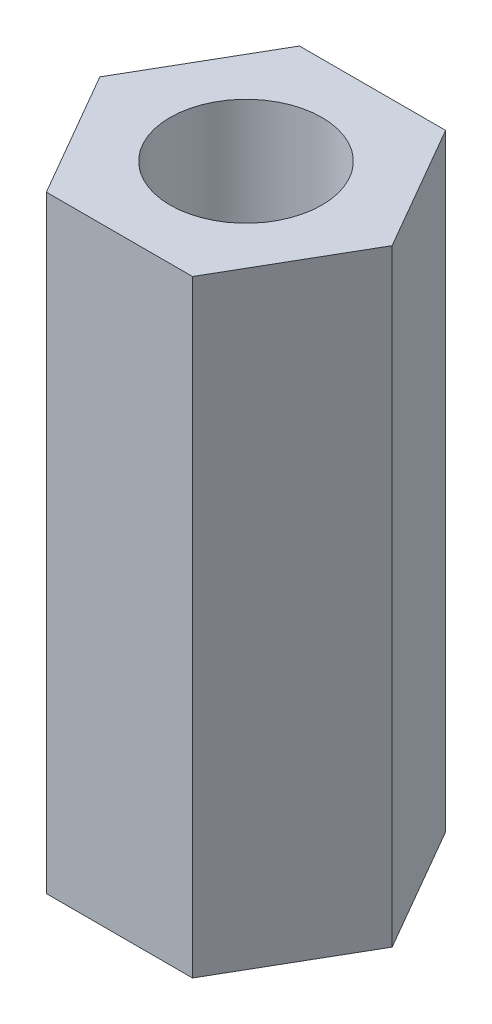
ISO-10303-21;
HEADER;
FILE_DESCRIPTION(('STEP AP214'),'2;1');
FILE_NAME('part.step','',(''),(''),'','','');
FILE_SCHEMA(('AUTOMOTIVE_DESIGN { 1 0 10303 214 1 1 1 1 }'));
ENDSEC;
DATA;
#1=APPLICATION_CONTEXT('core data for automotive mechanical design processes');
#2=APPLICATION_PROTOCOL_DEFINITION('international standard','automotive_design',2000,#1);
#3=PRODUCT_CONTEXT('',#1,'mechanical');
#4=PRODUCT('Part','Part','',(#3));
#5=PRODUCT_RELATED_PRODUCT_CATEGORY('part','',(#4));
#6=PRODUCT_DEFINITION_FORMATION('','',#4);
#7=PRODUCT_DEFINITION_CONTEXT('part definition',#1,'design');
#8=PRODUCT_DEFINITION('design','',#6,#7);
#9=PRODUCT_DEFINITION_SHAPE('','',#8);
#10=(LENGTH_UNIT() NAMED_UNIT(*) SI_UNIT(.MILLI.,.METRE.));
#11=(NAMED_UNIT(*) PLANE_ANGLE_UNIT() SI_UNIT($,.RADIAN.));
#12=(NAMED_UNIT(*) SI_UNIT($,.STERADIAN.) SOLID_ANGLE_UNIT());
#13=UNCERTAINTY_MEASURE_WITH_UNIT(LENGTH_MEASURE(1.E-05),#10,'distance_accuracy_value','');
#14=(GEOMETRIC_REPRESENTATION_CONTEXT(3) GLOBAL_UNCERTAINTY_ASSIGNED_CONTEXT((#13)) GLOBAL_UNIT_ASSIGNED_CONTEXT((#10,
#11,#12)) REPRESENTATION_CONTEXT('',''));
#15=CARTESIAN_POINT('',(0.,0.,0.));
#16=DIRECTION('',(0.,0.,1.));
#17=DIRECTION('',(1.,0.,0.));
#18=AXIS2_PLACEMENT_3D('',#15,#16,#17);
#19=CARTESIAN_POINT('',(0.,6.,0.));
#20=DIRECTION('',(0.,1.,0.));
#21=DIRECTION('',(0.,0.,1.));
#22=AXIS2_PLACEMENT_3D('',#19,#20,#21);
#23=PLANE('',#22);
#24=DIRECTION('',(1.,0.,0.));
#25=VECTOR('',#24,1.);
#26=CARTESIAN_POINT('',(-1.44337567297405,6.,2.5));
#27=LINE('',#26,#25);
#28=CARTESIAN_POINT('',(-1.44337567297405,6.,2.5));
#29=VERTEX_POINT('',#28);
#30=CARTESIAN_POINT('',(1.44337567297408,6.,2.5));
#31=VERTEX_POINT('',#30);
#32=EDGE_CURVE('E129',#29,#31,#27,.T.);
#33=ORIENTED_EDGE('',*,*,#32,.T.);
#34=DIRECTION('',(0.500000000000001,0.,-0.866025403784438));
#35=VECTOR('',#34,1.);
#36=CARTESIAN_POINT('',(1.44337567297408,6.,2.5));
#37=LINE('',#36,#35);
#38=CARTESIAN_POINT('',(2.88675134594815,6.,0.));
#39=VERTEX_POINT('',#38);
#40=EDGE_CURVE('E87',#31,#39,#37,.T.);
#41=ORIENTED_EDGE('',*,*,#40,.T.);
#42=DIRECTION('',(-0.500000000000001,0.,-0.866025403784438));
#43=VECTOR('',#42,1.);
#44=CARTESIAN_POINT('',(2.88675134594815,6.,0.));
#45=LINE('',#44,#43);
#46=CARTESIAN_POINT('',(1.44337567297408,6.,-2.50000000000001));
#47=VERTEX_POINT('',#46);
#48=EDGE_CURVE('E100',#39,#47,#45,.T.);
#49=ORIENTED_EDGE('',*,*,#48,.T.);
#50=DIRECTION('',(-1.,0.,0.));
#51=VECTOR('',#50,1.);
#52=CARTESIAN_POINT('',(1.44337567297408,6.,-2.50000000000001));
#53=LINE('',#52,#51);
#54=CARTESIAN_POINT('',(-1.44337567297405,6.,-2.50000000000001));
#55=VERTEX_POINT('',#54);
#56=EDGE_CURVE('E94',#47,#55,#53,.T.);
#57=ORIENTED_EDGE('',*,*,#56,.T.);
#58=DIRECTION('',(-0.5,0.,0.866025403784438));
#59=VECTOR('',#58,1.);
#60=CARTESIAN_POINT('',(-1.44337567297405,6.,-2.50000000000001));
#61=LINE('',#60,#59);
#62=CARTESIAN_POINT('',(-2.88675134594812,6.,0.));
#63=VERTEX_POINT('',#62);
#64=EDGE_CURVE('E98',#55,#63,#61,.T.);
#65=ORIENTED_EDGE('',*,*,#64,.T.);
#66=DIRECTION('',(0.5,0.,0.866025403784438));
#67=VECTOR('',#66,1.);
#68=CARTESIAN_POINT('',(-2.88675134594812,6.,0.));
#69=LINE('',#68,#67);
#70=EDGE_CURVE('E50',#63,#29,#69,.T.);
#71=ORIENTED_EDGE('',*,*,#70,.T.);
#72=EDGE_LOOP('',(#33,#41,#49,#57,#65,#71));
#73=FACE_BOUND('',#72,.T.);
#74=CARTESIAN_POINT('',(0.,6.,0.));
#75=DIRECTION('',(0.,1.,0.));
#76=DIRECTION('',(0.,0.,1.));
#77=AXIS2_PLACEMENT_3D('',#74,#75,#76);
#78=CIRCLE('',#77,1.5);
#79=CARTESIAN_POINT('',(0.,6.,1.5));
#80=VERTEX_POINT('',#79);
#81=EDGE_CURVE('E122',#80,#80,#78,.T.);
#82=ORIENTED_EDGE('',*,*,#81,.F.);
#83=EDGE_LOOP('',(#82));
#84=FACE_BOUND('',#83,.T.);
#85=ADVANCED_FACE('F33',(#73,#84),#23,.T.);
#86=CARTESIAN_POINT('',(0.,-6.,0.));
#87=DIRECTION('',(0.,1.,0.));
#88=DIRECTION('',(0.,0.,1.));
#89=AXIS2_PLACEMENT_3D('',#86,#87,#88);
#90=PLANE('',#89);
#91=DIRECTION('',(1.,0.,0.));
#92=VECTOR('',#91,1.);
#93=CARTESIAN_POINT('',(-1.44337567297405,-6.,2.5));
#94=LINE('',#93,#92);
#95=CARTESIAN_POINT('',(-1.44337567297405,-6.,2.5));
#96=VERTEX_POINT('',#95);
#97=CARTESIAN_POINT('',(1.44337567297408,-6.,2.5));
#98=VERTEX_POINT('',#97);
#99=EDGE_CURVE('E118',#96,#98,#94,.T.);
#100=ORIENTED_EDGE('',*,*,#99,.F.);
#101=DIRECTION('',(0.5,0.,0.866025403784438));
#102=VECTOR('',#101,1.);
#103=CARTESIAN_POINT('',(-2.88675134594812,-6.,0.));
#104=LINE('',#103,#102);
#105=CARTESIAN_POINT('',(-2.88675134594812,-6.,0.));
#106=VERTEX_POINT('',#105);
#107=EDGE_CURVE('E79',#106,#96,#104,.T.);
#108=ORIENTED_EDGE('',*,*,#107,.F.);
#109=DIRECTION('',(-0.5,0.,0.866025403784438));
#110=VECTOR('',#109,1.);
#111=CARTESIAN_POINT('',(-1.44337567297405,-6.,-2.50000000000001));
#112=LINE('',#111,#110);
#113=CARTESIAN_POINT('',(-1.44337567297405,-6.,-2.50000000000001));
#114=VERTEX_POINT('',#113);
#115=EDGE_CURVE('E73',#114,#106,#112,.T.);
#116=ORIENTED_EDGE('',*,*,#115,.F.);
#117=DIRECTION('',(-1.,0.,0.));
#118=VECTOR('',#117,1.);
#119=CARTESIAN_POINT('',(1.44337567297408,-6.,-2.50000000000001));
#120=LINE('',#119,#118);
#121=CARTESIAN_POINT('',(1.44337567297408,-6.,-2.50000000000001));
#122=VERTEX_POINT('',#121);
#123=EDGE_CURVE('E108',#122,#114,#120,.T.);
#124=ORIENTED_EDGE('',*,*,#123,.F.);
#125=DIRECTION('',(-0.500000000000001,0.,-0.866025403784438));
#126=VECTOR('',#125,1.);
#127=CARTESIAN_POINT('',(2.88675134594815,-6.,0.));
#128=LINE('',#127,#126);
#129=CARTESIAN_POINT('',(2.88675134594815,-6.,0.));
#130=VERTEX_POINT('',#129);
#131=EDGE_CURVE('E124',#130,#122,#128,.T.);
#132=ORIENTED_EDGE('',*,*,#131,.F.);
#133=DIRECTION('',(0.500000000000001,0.,-0.866025403784438));
#134=VECTOR('',#133,1.);
#135=CARTESIAN_POINT('',(1.44337567297408,-6.,2.5));
#136=LINE('',#135,#134);
#137=EDGE_CURVE('E121',#98,#130,#136,.T.);
#138=ORIENTED_EDGE('',*,*,#137,.F.);
#139=EDGE_LOOP('',(#100,#108,#116,#124,#132,#138));
#140=FACE_BOUND('',#139,.T.);
#141=CARTESIAN_POINT('',(0.,-6.,0.));
#142=DIRECTION('',(0.,1.,0.));
#143=DIRECTION('',(0.,0.,1.));
#144=AXIS2_PLACEMENT_3D('',#141,#142,#143);
#145=CIRCLE('',#144,1.5);
#146=CARTESIAN_POINT('',(0.,-6.,1.5));
#147=VERTEX_POINT('',#146);
#148=EDGE_CURVE('E222',#147,#147,#145,.T.);
#149=ORIENTED_EDGE('',*,*,#148,.T.);
#150=EDGE_LOOP('',(#149));
#151=FACE_BOUND('',#150,.T.);
#152=ADVANCED_FACE('F138',(#140,#151),#90,.F.);
#153=CARTESIAN_POINT('',(-1.44337567297405,6.,2.5));
#154=DIRECTION('',(0.,0.,-1.));
#155=DIRECTION('',(-1.,0.,0.));
#156=AXIS2_PLACEMENT_3D('',#153,#154,#155);
#157=PLANE('',#156);
#158=ORIENTED_EDGE('',*,*,#99,.T.);
#159=DIRECTION('',(0.,-1.,0.));
#160=VECTOR('',#159,1.);
#161=CARTESIAN_POINT('',(1.44337567297408,6.,2.5));
#162=LINE('',#161,#160);
#163=EDGE_CURVE('E11',#31,#98,#162,.T.);
#164=ORIENTED_EDGE('',*,*,#163,.F.);
#165=ORIENTED_EDGE('',*,*,#32,.F.);
#166=DIRECTION('',(0.,-1.,0.));
#167=VECTOR('',#166,1.);
#168=CARTESIAN_POINT('',(-1.44337567297405,6.,2.5));
#169=LINE('',#168,#167);
#170=EDGE_CURVE('E114',#29,#96,#169,.T.);
#171=ORIENTED_EDGE('',*,*,#170,.T.);
#172=EDGE_LOOP('',(#158,#164,#165,#171));
#173=FACE_BOUND('',#172,.T.);
#174=ADVANCED_FACE('F35',(#173),#157,.F.);
#175=CARTESIAN_POINT('',(1.44337567297408,6.,2.5));
#176=DIRECTION('',(-0.866025403784438,0.,-0.500000000000001));
#177=DIRECTION('',(-0.500000000000001,0.,0.866025403784438));
#178=AXIS2_PLACEMENT_3D('',#175,#176,#177);
#179=PLANE('',#178);
#180=ORIENTED_EDGE('',*,*,#137,.T.);
#181=DIRECTION('',(0.,-1.,0.));
#182=VECTOR('',#181,1.);
#183=CARTESIAN_POINT('',(2.88675134594815,6.,0.));
#184=LINE('',#183,#182);
#185=EDGE_CURVE('E42',#39,#130,#184,.T.);
#186=ORIENTED_EDGE('',*,*,#185,.F.);
#187=ORIENTED_EDGE('',*,*,#40,.F.);
#188=ORIENTED_EDGE('',*,*,#163,.T.);
#189=EDGE_LOOP('',(#180,#186,#187,#188));
#190=FACE_BOUND('',#189,.T.);
#191=ADVANCED_FACE('F163',(#190),#179,.F.);
#192=CARTESIAN_POINT('',(2.88675134594815,6.,0.));
#193=DIRECTION('',(-0.866025403784438,0.,0.500000000000001));
#194=DIRECTION('',(0.500000000000001,0.,0.866025403784438));
#195=AXIS2_PLACEMENT_3D('',#192,#193,#194);
#196=PLANE('',#195);
#197=ORIENTED_EDGE('',*,*,#131,.T.);
#198=DIRECTION('',(0.,-1.,0.));
#199=VECTOR('',#198,1.);
#200=CARTESIAN_POINT('',(1.44337567297408,6.,-2.50000000000001));
#201=LINE('',#200,#199);
#202=EDGE_CURVE('E109',#47,#122,#201,.T.);
#203=ORIENTED_EDGE('',*,*,#202,.F.);
#204=ORIENTED_EDGE('',*,*,#48,.F.);
#205=ORIENTED_EDGE('',*,*,#185,.T.);
#206=EDGE_LOOP('',(#197,#203,#204,#205));
#207=FACE_BOUND('',#206,.T.);
#208=ADVANCED_FACE('F135',(#207),#196,.F.);
#209=CARTESIAN_POINT('',(1.44337567297408,6.,-2.50000000000001));
#210=DIRECTION('',(0.,0.,1.));
#211=DIRECTION('',(1.,0.,0.));
#212=AXIS2_PLACEMENT_3D('',#209,#210,#211);
#213=PLANE('',#212);
#214=ORIENTED_EDGE('',*,*,#123,.T.);
#215=DIRECTION('',(0.,-1.,0.));
#216=VECTOR('',#215,1.);
#217=CARTESIAN_POINT('',(-1.44337567297405,6.,-2.50000000000001));
#218=LINE('',#217,#216);
#219=EDGE_CURVE('E105',#55,#114,#218,.T.);
#220=ORIENTED_EDGE('',*,*,#219,.F.);
#221=ORIENTED_EDGE('',*,*,#56,.F.);
#222=ORIENTED_EDGE('',*,*,#202,.T.);
#223=EDGE_LOOP('',(#214,#220,#221,#222));
#224=FACE_BOUND('',#223,.T.);
#225=ADVANCED_FACE('F106',(#224),#213,.F.);
#226=CARTESIAN_POINT('',(-1.44337567297405,6.,-2.50000000000001));
#227=DIRECTION('',(0.866025403784439,0.,0.5));
#228=DIRECTION('',(0.5,0.,-0.866025403784439));
#229=AXIS2_PLACEMENT_3D('',#226,#227,#228);
#230=PLANE('',#229);
#231=ORIENTED_EDGE('',*,*,#115,.T.);
#232=DIRECTION('',(0.,-1.,0.));
#233=VECTOR('',#232,1.);
#234=CARTESIAN_POINT('',(-2.88675134594812,6.,0.));
#235=LINE('',#234,#233);
#236=EDGE_CURVE('E110',#63,#106,#235,.T.);
#237=ORIENTED_EDGE('',*,*,#236,.F.);
#238=ORIENTED_EDGE('',*,*,#64,.F.);
#239=ORIENTED_EDGE('',*,*,#219,.T.);
#240=EDGE_LOOP('',(#231,#237,#238,#239));
#241=FACE_BOUND('',#240,.T.);
#242=ADVANCED_FACE('F112',(#241),#230,.F.);
#243=CARTESIAN_POINT('',(-2.88675134594812,6.,0.));
#244=DIRECTION('',(0.866025403784438,0.,-0.500000000000001));
#245=DIRECTION('',(-0.500000000000001,0.,-0.866025403784438));
#246=AXIS2_PLACEMENT_3D('',#243,#244,#245);
#247=PLANE('',#246);
#248=ORIENTED_EDGE('',*,*,#107,.T.);
#249=ORIENTED_EDGE('',*,*,#170,.F.);
#250=ORIENTED_EDGE('',*,*,#70,.F.);
#251=ORIENTED_EDGE('',*,*,#236,.T.);
#252=EDGE_LOOP('',(#248,#249,#250,#251));
#253=FACE_BOUND('',#252,.T.);
#254=ADVANCED_FACE('F143',(#253),#247,.F.);
#255=CARTESIAN_POINT('',(0.,6.,0.));
#256=DIRECTION('',(0.,-1.,0.));
#257=DIRECTION('',(0.,0.,-1.));
#258=AXIS2_PLACEMENT_3D('',#255,#256,#257);
#259=CYLINDRICAL_SURFACE('',#258,1.5);
#260=ORIENTED_EDGE('',*,*,#81,.T.);
#261=EDGE_LOOP('',(#260));
#262=FACE_BOUND('',#261,.T.);
#263=ORIENTED_EDGE('',*,*,#148,.F.);
#264=EDGE_LOOP('',(#263));
#265=FACE_BOUND('',#264,.T.);
#266=ADVANCED_FACE('F145',(#262,#265),#259,.F.);
#267=CLOSED_SHELL('',(#85,#152,#174,#191,#208,#225,#242,#254,#266));
#268=MANIFOLD_SOLID_BREP('B2',#267);
#269=ADVANCED_BREP_SHAPE_REPRESENTATION('',(#18,#268),#14);
#270=SHAPE_DEFINITION_REPRESENTATION(#9,#269);
ENDSEC;
END-ISO-10303-21;
